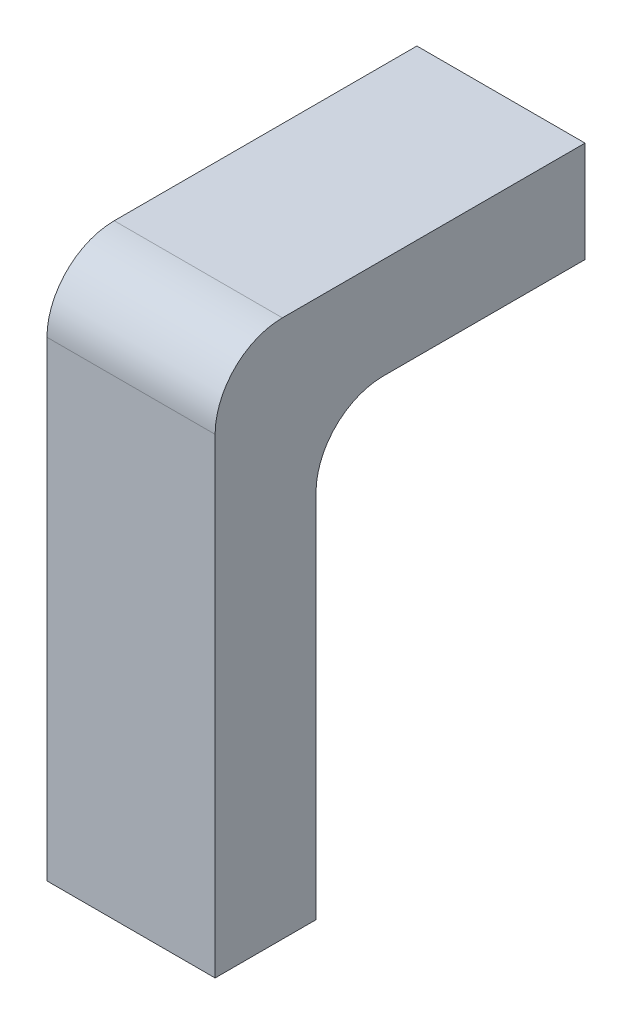
ISO-10303-21;
HEADER;
FILE_DESCRIPTION(('STEP AP214'),'2;1');
FILE_NAME('part.step','',(''),(''),'','','');
FILE_SCHEMA(('AUTOMOTIVE_DESIGN { 1 0 10303 214 1 1 1 1 }'));
ENDSEC;
DATA;
#1=APPLICATION_CONTEXT('core data for automotive mechanical design processes');
#2=APPLICATION_PROTOCOL_DEFINITION('international standard','automotive_design',2000,#1);
#3=PRODUCT_CONTEXT('',#1,'mechanical');
#4=PRODUCT('Part','Part','',(#3));
#5=PRODUCT_RELATED_PRODUCT_CATEGORY('part','',(#4));
#6=PRODUCT_DEFINITION_FORMATION('','',#4);
#7=PRODUCT_DEFINITION_CONTEXT('part definition',#1,'design');
#8=PRODUCT_DEFINITION('design','',#6,#7);
#9=PRODUCT_DEFINITION_SHAPE('','',#8);
#10=(LENGTH_UNIT() NAMED_UNIT(*) SI_UNIT(.MILLI.,.METRE.));
#11=(NAMED_UNIT(*) PLANE_ANGLE_UNIT() SI_UNIT($,.RADIAN.));
#12=(NAMED_UNIT(*) SI_UNIT($,.STERADIAN.) SOLID_ANGLE_UNIT());
#13=UNCERTAINTY_MEASURE_WITH_UNIT(LENGTH_MEASURE(1.E-05),#10,'distance_accuracy_value','');
#14=(GEOMETRIC_REPRESENTATION_CONTEXT(3) GLOBAL_UNCERTAINTY_ASSIGNED_CONTEXT((#13)) GLOBAL_UNIT_ASSIGNED_CONTEXT((#10,
#11,#12)) REPRESENTATION_CONTEXT('',''));
#15=CARTESIAN_POINT('',(0.,0.,0.));
#16=DIRECTION('',(0.,0.,1.));
#17=DIRECTION('',(1.,0.,0.));
#18=AXIS2_PLACEMENT_3D('',#15,#16,#17);
#19=CARTESIAN_POINT('',(-1.25,8.,-0.75));
#20=DIRECTION('',(0.,0.,1.));
#21=DIRECTION('',(1.,0.,0.));
#22=AXIS2_PLACEMENT_3D('',#19,#20,#21);
#23=PLANE('',#22);
#24=DIRECTION('',(0.,-1.,0.));
#25=VECTOR('',#24,1.);
#26=CARTESIAN_POINT('',(-1.25,8.,-0.75));
#27=LINE('',#26,#25);
#28=CARTESIAN_POINT('',(-1.25,5.5,-0.75));
#29=VERTEX_POINT('',#28);
#30=CARTESIAN_POINT('',(-1.25,0.,-0.75));
#31=VERTEX_POINT('',#30);
#32=EDGE_CURVE('E161',#29,#31,#27,.T.);
#33=ORIENTED_EDGE('',*,*,#32,.F.);
#34=DIRECTION('',(-1.,0.,0.));
#35=VECTOR('',#34,1.);
#36=CARTESIAN_POINT('',(1.25,5.5,-0.75));
#37=LINE('',#36,#35);
#38=CARTESIAN_POINT('',(1.25,5.5,-0.75));
#39=VERTEX_POINT('',#38);
#40=EDGE_CURVE('E167',#29,#39,#37,.F.);
#41=ORIENTED_EDGE('',*,*,#40,.T.);
#42=DIRECTION('',(0.,-1.,0.));
#43=VECTOR('',#42,1.);
#44=CARTESIAN_POINT('',(1.25,8.,-0.75));
#45=LINE('',#44,#43);
#46=CARTESIAN_POINT('',(1.25,0.,-0.75));
#47=VERTEX_POINT('',#46);
#48=EDGE_CURVE('E163',#39,#47,#45,.T.);
#49=ORIENTED_EDGE('',*,*,#48,.T.);
#50=DIRECTION('',(-1.,0.,0.));
#51=VECTOR('',#50,1.);
#52=CARTESIAN_POINT('',(-1.25,0.,-0.75));
#53=LINE('',#52,#51);
#54=EDGE_CURVE('E150',#47,#31,#53,.T.);
#55=ORIENTED_EDGE('',*,*,#54,.T.);
#56=EDGE_LOOP('',(#33,#41,#49,#55));
#57=FACE_BOUND('',#56,.T.);
#58=ADVANCED_FACE('F35',(#57),#23,.F.);
#59=CARTESIAN_POINT('',(1.25,8.,-0.75));
#60=DIRECTION('',(-1.,0.,0.));
#61=DIRECTION('',(0.,0.,1.));
#62=AXIS2_PLACEMENT_3D('',#59,#60,#61);
#63=PLANE('',#62);
#64=DIRECTION('',(0.,0.,-1.));
#65=VECTOR('',#64,1.);
#66=CARTESIAN_POINT('',(1.25,8.,-0.75));
#67=LINE('',#66,#65);
#68=CARTESIAN_POINT('',(1.25,8.,-0.25));
#69=VERTEX_POINT('',#68);
#70=CARTESIAN_POINT('',(1.25,8.,-4.75));
#71=VERTEX_POINT('',#70);
#72=EDGE_CURVE('E141',#69,#71,#67,.T.);
#73=ORIENTED_EDGE('',*,*,#72,.F.);
#74=CARTESIAN_POINT('',(1.25,7.,-0.25));
#75=DIRECTION('',(-1.,0.,0.));
#76=DIRECTION('',(0.,0.,1.));
#77=AXIS2_PLACEMENT_3D('',#74,#75,#76);
#78=CIRCLE('',#77,1.);
#79=CARTESIAN_POINT('',(1.25,7.,0.75));
#80=VERTEX_POINT('',#79);
#81=EDGE_CURVE('E58',#69,#80,#78,.F.);
#82=ORIENTED_EDGE('',*,*,#81,.T.);
#83=DIRECTION('',(0.,-1.,0.));
#84=VECTOR('',#83,1.);
#85=CARTESIAN_POINT('',(1.25,8.,0.75));
#86=LINE('',#85,#84);
#87=CARTESIAN_POINT('',(1.25,0.,0.75));
#88=VERTEX_POINT('',#87);
#89=EDGE_CURVE('E147',#80,#88,#86,.T.);
#90=ORIENTED_EDGE('',*,*,#89,.T.);
#91=DIRECTION('',(0.,0.,-1.));
#92=VECTOR('',#91,1.);
#93=CARTESIAN_POINT('',(1.25,0.,-0.75));
#94=LINE('',#93,#92);
#95=EDGE_CURVE('E135',#88,#47,#94,.T.);
#96=ORIENTED_EDGE('',*,*,#95,.T.);
#97=ORIENTED_EDGE('',*,*,#48,.F.);
#98=CARTESIAN_POINT('',(1.25,5.5,-1.75));
#99=DIRECTION('',(-1.,0.,0.));
#100=DIRECTION('',(0.,0.,1.));
#101=AXIS2_PLACEMENT_3D('',#98,#99,#100);
#102=CIRCLE('',#101,1.);
#103=CARTESIAN_POINT('',(1.25,6.5,-1.75));
#104=VERTEX_POINT('',#103);
#105=EDGE_CURVE('E11',#39,#104,#102,.T.);
#106=ORIENTED_EDGE('',*,*,#105,.T.);
#107=DIRECTION('',(0.,0.,1.));
#108=VECTOR('',#107,1.);
#109=CARTESIAN_POINT('',(1.25,6.5,-4.75));
#110=LINE('',#109,#108);
#111=CARTESIAN_POINT('',(1.25,6.5,-4.75));
#112=VERTEX_POINT('',#111);
#113=EDGE_CURVE('E104',#112,#104,#110,.T.);
#114=ORIENTED_EDGE('',*,*,#113,.F.);
#115=DIRECTION('',(0.,-1.,0.));
#116=VECTOR('',#115,1.);
#117=CARTESIAN_POINT('',(1.25,6.5,-4.75));
#118=LINE('',#117,#116);
#119=EDGE_CURVE('E112',#71,#112,#118,.T.);
#120=ORIENTED_EDGE('',*,*,#119,.F.);
#121=EDGE_LOOP('',(#73,#82,#90,#96,#97,#106,#114,#120));
#122=FACE_BOUND('',#121,.T.);
#123=ADVANCED_FACE('F121',(#122),#63,.F.);
#124=CARTESIAN_POINT('',(-1.25,8.,-0.75));
#125=DIRECTION('',(1.,0.,0.));
#126=DIRECTION('',(0.,0.,-1.));
#127=AXIS2_PLACEMENT_3D('',#124,#125,#126);
#128=PLANE('',#127);
#129=DIRECTION('',(0.,-1.,0.));
#130=VECTOR('',#129,1.);
#131=CARTESIAN_POINT('',(-1.25,8.,0.75));
#132=LINE('',#131,#130);
#133=CARTESIAN_POINT('',(-1.25,7.,0.75));
#134=VERTEX_POINT('',#133);
#135=CARTESIAN_POINT('',(-1.25,0.,0.75));
#136=VERTEX_POINT('',#135);
#137=EDGE_CURVE('E159',#134,#136,#132,.T.);
#138=ORIENTED_EDGE('',*,*,#137,.F.);
#139=CARTESIAN_POINT('',(-1.25,7.,-0.25));
#140=DIRECTION('',(1.,0.,0.));
#141=DIRECTION('',(0.,0.,-1.));
#142=AXIS2_PLACEMENT_3D('',#139,#140,#141);
#143=CIRCLE('',#142,1.);
#144=CARTESIAN_POINT('',(-1.25,8.,-0.25));
#145=VERTEX_POINT('',#144);
#146=EDGE_CURVE('E174',#134,#145,#143,.F.);
#147=ORIENTED_EDGE('',*,*,#146,.T.);
#148=DIRECTION('',(0.,0.,1.));
#149=VECTOR('',#148,1.);
#150=CARTESIAN_POINT('',(-1.25,8.,-0.75));
#151=LINE('',#150,#149);
#152=CARTESIAN_POINT('',(-1.25,8.,-4.75));
#153=VERTEX_POINT('',#152);
#154=EDGE_CURVE('E143',#153,#145,#151,.T.);
#155=ORIENTED_EDGE('',*,*,#154,.F.);
#156=DIRECTION('',(0.,1.,0.));
#157=VECTOR('',#156,1.);
#158=CARTESIAN_POINT('',(-1.25,8.,-4.75));
#159=LINE('',#158,#157);
#160=CARTESIAN_POINT('',(-1.25,6.5,-4.75));
#161=VERTEX_POINT('',#160);
#162=EDGE_CURVE('E111',#161,#153,#159,.T.);
#163=ORIENTED_EDGE('',*,*,#162,.F.);
#164=DIRECTION('',(0.,0.,1.));
#165=VECTOR('',#164,1.);
#166=CARTESIAN_POINT('',(-1.25,6.5,-4.75));
#167=LINE('',#166,#165);
#168=CARTESIAN_POINT('',(-1.25,6.5,-1.75));
#169=VERTEX_POINT('',#168);
#170=EDGE_CURVE('E107',#161,#169,#167,.T.);
#171=ORIENTED_EDGE('',*,*,#170,.T.);
#172=CARTESIAN_POINT('',(-1.25,5.5,-1.75));
#173=DIRECTION('',(1.,0.,0.));
#174=DIRECTION('',(0.,0.,-1.));
#175=AXIS2_PLACEMENT_3D('',#172,#173,#174);
#176=CIRCLE('',#175,1.);
#177=EDGE_CURVE('E43',#169,#29,#176,.T.);
#178=ORIENTED_EDGE('',*,*,#177,.T.);
#179=ORIENTED_EDGE('',*,*,#32,.T.);
#180=DIRECTION('',(0.,0.,1.));
#181=VECTOR('',#180,1.);
#182=CARTESIAN_POINT('',(-1.25,0.,-0.75));
#183=LINE('',#182,#181);
#184=EDGE_CURVE('E153',#31,#136,#183,.T.);
#185=ORIENTED_EDGE('',*,*,#184,.T.);
#186=EDGE_LOOP('',(#138,#147,#155,#163,#171,#178,#179,#185));
#187=FACE_BOUND('',#186,.T.);
#188=ADVANCED_FACE('F177',(#187),#128,.F.);
#189=CARTESIAN_POINT('',(-1.25,8.,0.75));
#190=DIRECTION('',(0.,0.,-1.));
#191=DIRECTION('',(-1.,0.,0.));
#192=AXIS2_PLACEMENT_3D('',#189,#190,#191);
#193=PLANE('',#192);
#194=ORIENTED_EDGE('',*,*,#89,.F.);
#195=DIRECTION('',(1.,0.,0.));
#196=VECTOR('',#195,1.);
#197=CARTESIAN_POINT('',(-1.25,7.,0.75));
#198=LINE('',#197,#196);
#199=EDGE_CURVE('E50',#80,#134,#198,.F.);
#200=ORIENTED_EDGE('',*,*,#199,.T.);
#201=ORIENTED_EDGE('',*,*,#137,.T.);
#202=DIRECTION('',(1.,0.,0.));
#203=VECTOR('',#202,1.);
#204=CARTESIAN_POINT('',(-1.25,0.,0.75));
#205=LINE('',#204,#203);
#206=EDGE_CURVE('E144',#136,#88,#205,.T.);
#207=ORIENTED_EDGE('',*,*,#206,.T.);
#208=EDGE_LOOP('',(#194,#200,#201,#207));
#209=FACE_BOUND('',#208,.T.);
#210=ADVANCED_FACE('F202',(#209),#193,.F.);
#211=CARTESIAN_POINT('',(0.,8.,0.));
#212=DIRECTION('',(0.,1.,0.));
#213=DIRECTION('',(0.,0.,1.));
#214=AXIS2_PLACEMENT_3D('',#211,#212,#213);
#215=PLANE('',#214);
#216=ORIENTED_EDGE('',*,*,#154,.T.);
#217=DIRECTION('',(1.,0.,0.));
#218=VECTOR('',#217,1.);
#219=CARTESIAN_POINT('',(1.25,8.,-0.25));
#220=LINE('',#219,#218);
#221=EDGE_CURVE('E169',#145,#69,#220,.T.);
#222=ORIENTED_EDGE('',*,*,#221,.T.);
#223=ORIENTED_EDGE('',*,*,#72,.T.);
#224=DIRECTION('',(1.,0.,0.));
#225=VECTOR('',#224,1.);
#226=CARTESIAN_POINT('',(1.25,8.,-4.75));
#227=LINE('',#226,#225);
#228=EDGE_CURVE('E118',#153,#71,#227,.T.);
#229=ORIENTED_EDGE('',*,*,#228,.F.);
#230=EDGE_LOOP('',(#216,#222,#223,#229));
#231=FACE_BOUND('',#230,.T.);
#232=ADVANCED_FACE('F205',(#231),#215,.T.);
#233=CARTESIAN_POINT('',(0.,0.,0.));
#234=DIRECTION('',(0.,1.,0.));
#235=DIRECTION('',(0.,0.,1.));
#236=AXIS2_PLACEMENT_3D('',#233,#234,#235);
#237=PLANE('',#236);
#238=CARTESIAN_POINT('',(0.535,0.,0.));
#239=DIRECTION('',(0.,-1.,0.));
#240=DIRECTION('',(0.,0.,-1.));
#241=AXIS2_PLACEMENT_3D('',#238,#239,#240);
#242=CIRCLE('',#241,0.435);
#243=CARTESIAN_POINT('',(0.535,0.,-0.435));
#244=VERTEX_POINT('',#243);
#245=EDGE_CURVE('E136',#244,#244,#242,.T.);
#246=ORIENTED_EDGE('',*,*,#245,.F.);
#247=EDGE_LOOP('',(#246));
#248=FACE_BOUND('',#247,.T.);
#249=CARTESIAN_POINT('',(-0.535,0.,0.));
#250=DIRECTION('',(0.,-1.,0.));
#251=DIRECTION('',(0.,0.,-1.));
#252=AXIS2_PLACEMENT_3D('',#249,#250,#251);
#253=CIRCLE('',#252,0.435);
#254=CARTESIAN_POINT('',(-0.535,0.,-0.435));
#255=VERTEX_POINT('',#254);
#256=EDGE_CURVE('E124',#255,#255,#253,.T.);
#257=ORIENTED_EDGE('',*,*,#256,.F.);
#258=EDGE_LOOP('',(#257));
#259=FACE_BOUND('',#258,.T.);
#260=ORIENTED_EDGE('',*,*,#95,.F.);
#261=ORIENTED_EDGE('',*,*,#206,.F.);
#262=ORIENTED_EDGE('',*,*,#184,.F.);
#263=ORIENTED_EDGE('',*,*,#54,.F.);
#264=EDGE_LOOP('',(#260,#261,#262,#263));
#265=FACE_BOUND('',#264,.T.);
#266=ADVANCED_FACE('F206',(#248,#259,#265),#237,.F.);
#267=CARTESIAN_POINT('',(-0.535,3.,0.));
#268=DIRECTION('',(0.,-1.,0.));
#269=DIRECTION('',(0.,0.,-1.));
#270=AXIS2_PLACEMENT_3D('',#267,#268,#269);
#271=CYLINDRICAL_SURFACE('',#270,0.435);
#272=CARTESIAN_POINT('',(-0.535,3.,0.));
#273=DIRECTION('',(0.,-1.,0.));
#274=DIRECTION('',(0.,0.,-1.));
#275=AXIS2_PLACEMENT_3D('',#272,#273,#274);
#276=CIRCLE('',#275,0.435);
#277=CARTESIAN_POINT('',(-0.535,3.,-0.435));
#278=VERTEX_POINT('',#277);
#279=EDGE_CURVE('E127',#278,#278,#276,.T.);
#280=ORIENTED_EDGE('',*,*,#279,.F.);
#281=EDGE_LOOP('',(#280));
#282=FACE_BOUND('',#281,.T.);
#283=ORIENTED_EDGE('',*,*,#256,.T.);
#284=EDGE_LOOP('',(#283));
#285=FACE_BOUND('',#284,.T.);
#286=ADVANCED_FACE('F209',(#282,#285),#271,.F.);
#287=CARTESIAN_POINT('',(-0.535,3.,0.));
#288=DIRECTION('',(0.,-1.,0.));
#289=DIRECTION('',(0.,0.,-1.));
#290=AXIS2_PLACEMENT_3D('',#287,#288,#289);
#291=PLANE('',#290);
#292=ORIENTED_EDGE('',*,*,#279,.T.);
#293=EDGE_LOOP('',(#292));
#294=FACE_BOUND('',#293,.T.);
#295=ADVANCED_FACE('F216',(#294),#291,.T.);
#296=CARTESIAN_POINT('',(0.535,3.,0.));
#297=DIRECTION('',(0.,-1.,0.));
#298=DIRECTION('',(0.,0.,-1.));
#299=AXIS2_PLACEMENT_3D('',#296,#297,#298);
#300=CYLINDRICAL_SURFACE('',#299,0.435);
#301=CARTESIAN_POINT('',(0.535,3.,0.));
#302=DIRECTION('',(0.,-1.,0.));
#303=DIRECTION('',(0.,0.,-1.));
#304=AXIS2_PLACEMENT_3D('',#301,#302,#303);
#305=CIRCLE('',#304,0.435);
#306=CARTESIAN_POINT('',(0.535,3.,-0.435));
#307=VERTEX_POINT('',#306);
#308=EDGE_CURVE('E132',#307,#307,#305,.T.);
#309=ORIENTED_EDGE('',*,*,#308,.F.);
#310=EDGE_LOOP('',(#309));
#311=FACE_BOUND('',#310,.T.);
#312=ORIENTED_EDGE('',*,*,#245,.T.);
#313=EDGE_LOOP('',(#312));
#314=FACE_BOUND('',#313,.T.);
#315=ADVANCED_FACE('F220',(#311,#314),#300,.F.);
#316=CARTESIAN_POINT('',(0.535,3.,0.));
#317=DIRECTION('',(0.,-1.,0.));
#318=DIRECTION('',(0.,0.,-1.));
#319=AXIS2_PLACEMENT_3D('',#316,#317,#318);
#320=PLANE('',#319);
#321=ORIENTED_EDGE('',*,*,#308,.T.);
#322=EDGE_LOOP('',(#321));
#323=FACE_BOUND('',#322,.T.);
#324=ADVANCED_FACE('F224',(#323),#320,.T.);
#325=CARTESIAN_POINT('',(-1.25,6.5,-4.75));
#326=DIRECTION('',(0.,1.,0.));
#327=DIRECTION('',(0.,0.,1.));
#328=AXIS2_PLACEMENT_3D('',#325,#326,#327);
#329=PLANE('',#328);
#330=ORIENTED_EDGE('',*,*,#113,.T.);
#331=DIRECTION('',(-1.,0.,0.));
#332=VECTOR('',#331,1.);
#333=CARTESIAN_POINT('',(-1.25,6.5,-1.75));
#334=LINE('',#333,#332);
#335=EDGE_CURVE('E165',#104,#169,#334,.T.);
#336=ORIENTED_EDGE('',*,*,#335,.T.);
#337=ORIENTED_EDGE('',*,*,#170,.F.);
#338=DIRECTION('',(-1.,0.,0.));
#339=VECTOR('',#338,1.);
#340=CARTESIAN_POINT('',(-1.25,6.5,-4.75));
#341=LINE('',#340,#339);
#342=EDGE_CURVE('E99',#112,#161,#341,.T.);
#343=ORIENTED_EDGE('',*,*,#342,.F.);
#344=EDGE_LOOP('',(#330,#336,#337,#343));
#345=FACE_BOUND('',#344,.T.);
#346=ADVANCED_FACE('F101',(#345),#329,.F.);
#347=CARTESIAN_POINT('',(0.,0.,-4.75));
#348=DIRECTION('',(0.,0.,1.));
#349=DIRECTION('',(1.,0.,0.));
#350=AXIS2_PLACEMENT_3D('',#347,#348,#349);
#351=PLANE('',#350);
#352=CARTESIAN_POINT('',(0.535,7.25,-4.75));
#353=DIRECTION('',(0.,0.,-1.));
#354=DIRECTION('',(-1.,0.,0.));
#355=AXIS2_PLACEMENT_3D('',#352,#353,#354);
#356=CIRCLE('',#355,0.435);
#357=CARTESIAN_POINT('',(0.1,7.25,-4.75));
#358=VERTEX_POINT('',#357);
#359=EDGE_CURVE('E249',#358,#358,#356,.T.);
#360=ORIENTED_EDGE('',*,*,#359,.F.);
#361=EDGE_LOOP('',(#360));
#362=FACE_BOUND('',#361,.T.);
#363=CARTESIAN_POINT('',(-0.535,7.25,-4.75));
#364=DIRECTION('',(0.,0.,-1.));
#365=DIRECTION('',(-1.,0.,0.));
#366=AXIS2_PLACEMENT_3D('',#363,#364,#365);
#367=CIRCLE('',#366,0.435);
#368=CARTESIAN_POINT('',(-0.97,7.25,-4.75));
#369=VERTEX_POINT('',#368);
#370=EDGE_CURVE('E257',#369,#369,#367,.T.);
#371=ORIENTED_EDGE('',*,*,#370,.F.);
#372=EDGE_LOOP('',(#371));
#373=FACE_BOUND('',#372,.T.);
#374=ORIENTED_EDGE('',*,*,#119,.T.);
#375=ORIENTED_EDGE('',*,*,#342,.T.);
#376=ORIENTED_EDGE('',*,*,#162,.T.);
#377=ORIENTED_EDGE('',*,*,#228,.T.);
#378=EDGE_LOOP('',(#374,#375,#376,#377));
#379=FACE_BOUND('',#378,.T.);
#380=ADVANCED_FACE('F116',(#362,#373,#379),#351,.F.);
#381=CARTESIAN_POINT('',(-1.25,5.5,-1.75));
#382=DIRECTION('',(1.,0.,0.));
#383=DIRECTION('',(0.,0.,-1.));
#384=AXIS2_PLACEMENT_3D('',#381,#382,#383);
#385=CYLINDRICAL_SURFACE('',#384,1.);
#386=ORIENTED_EDGE('',*,*,#105,.F.);
#387=ORIENTED_EDGE('',*,*,#40,.F.);
#388=ORIENTED_EDGE('',*,*,#177,.F.);
#389=ORIENTED_EDGE('',*,*,#335,.F.);
#390=EDGE_LOOP('',(#386,#387,#388,#389));
#391=FACE_BOUND('',#390,.T.);
#392=ADVANCED_FACE('F183',(#391),#385,.F.);
#393=CARTESIAN_POINT('',(0.,7.,-0.25));
#394=DIRECTION('',(-1.,0.,0.));
#395=DIRECTION('',(0.,0.,1.));
#396=AXIS2_PLACEMENT_3D('',#393,#394,#395);
#397=CYLINDRICAL_SURFACE('',#396,1.);
#398=ORIENTED_EDGE('',*,*,#146,.F.);
#399=ORIENTED_EDGE('',*,*,#199,.F.);
#400=ORIENTED_EDGE('',*,*,#81,.F.);
#401=ORIENTED_EDGE('',*,*,#221,.F.);
#402=EDGE_LOOP('',(#398,#399,#400,#401));
#403=FACE_BOUND('',#402,.T.);
#404=ADVANCED_FACE('F37',(#403),#397,.T.);
#405=CARTESIAN_POINT('',(-0.535,7.25,-2.75));
#406=DIRECTION('',(0.,0.,-1.));
#407=DIRECTION('',(-1.,0.,0.));
#408=AXIS2_PLACEMENT_3D('',#405,#406,#407);
#409=CYLINDRICAL_SURFACE('',#408,0.435);
#410=CARTESIAN_POINT('',(-0.535,7.25,-2.75));
#411=DIRECTION('',(0.,0.,-1.));
#412=DIRECTION('',(-1.,0.,0.));
#413=AXIS2_PLACEMENT_3D('',#410,#411,#412);
#414=CIRCLE('',#413,0.435);
#415=CARTESIAN_POINT('',(-0.97,7.25,-2.75));
#416=VERTEX_POINT('',#415);
#417=EDGE_CURVE('E252',#416,#416,#414,.T.);
#418=ORIENTED_EDGE('',*,*,#417,.F.);
#419=EDGE_LOOP('',(#418));
#420=FACE_BOUND('',#419,.T.);
#421=ORIENTED_EDGE('',*,*,#370,.T.);
#422=EDGE_LOOP('',(#421));
#423=FACE_BOUND('',#422,.T.);
#424=ADVANCED_FACE('F189',(#420,#423),#409,.F.);
#425=CARTESIAN_POINT('',(-0.535,7.25,-2.75));
#426=DIRECTION('',(0.,0.,-1.));
#427=DIRECTION('',(-1.,0.,0.));
#428=AXIS2_PLACEMENT_3D('',#425,#426,#427);
#429=PLANE('',#428);
#430=ORIENTED_EDGE('',*,*,#417,.T.);
#431=EDGE_LOOP('',(#430));
#432=FACE_BOUND('',#431,.T.);
#433=ADVANCED_FACE('F233',(#432),#429,.T.);
#434=CARTESIAN_POINT('',(0.535,7.25,-2.75));
#435=DIRECTION('',(0.,0.,-1.));
#436=DIRECTION('',(-1.,0.,0.));
#437=AXIS2_PLACEMENT_3D('',#434,#435,#436);
#438=CYLINDRICAL_SURFACE('',#437,0.435);
#439=CARTESIAN_POINT('',(0.535,7.25,-2.75));
#440=DIRECTION('',(0.,0.,-1.));
#441=DIRECTION('',(-1.,0.,0.));
#442=AXIS2_PLACEMENT_3D('',#439,#440,#441);
#443=CIRCLE('',#442,0.435);
#444=CARTESIAN_POINT('',(0.1,7.25,-2.75));
#445=VERTEX_POINT('',#444);
#446=EDGE_CURVE('E119',#445,#445,#443,.T.);
#447=ORIENTED_EDGE('',*,*,#446,.F.);
#448=EDGE_LOOP('',(#447));
#449=FACE_BOUND('',#448,.T.);
#450=ORIENTED_EDGE('',*,*,#359,.T.);
#451=EDGE_LOOP('',(#450));
#452=FACE_BOUND('',#451,.T.);
#453=ADVANCED_FACE('F237',(#449,#452),#438,.F.);
#454=CARTESIAN_POINT('',(0.535,7.25,-2.75));
#455=DIRECTION('',(0.,0.,-1.));
#456=DIRECTION('',(-1.,0.,0.));
#457=AXIS2_PLACEMENT_3D('',#454,#455,#456);
#458=PLANE('',#457);
#459=ORIENTED_EDGE('',*,*,#446,.T.);
#460=EDGE_LOOP('',(#459));
#461=FACE_BOUND('',#460,.T.);
#462=ADVANCED_FACE('F241',(#461),#458,.T.);
#463=CLOSED_SHELL('',(#58,#123,#188,#210,#232,#266,#286,#295,#315,#324,#346,#380,#392,#404,#424,
#433,#453,#462));
#464=MANIFOLD_SOLID_BREP('B2',#463);
#465=ADVANCED_BREP_SHAPE_REPRESENTATION('',(#18,#464),#14);
#466=SHAPE_DEFINITION_REPRESENTATION(#9,#465);
ENDSEC;
END-ISO-10303-21;
